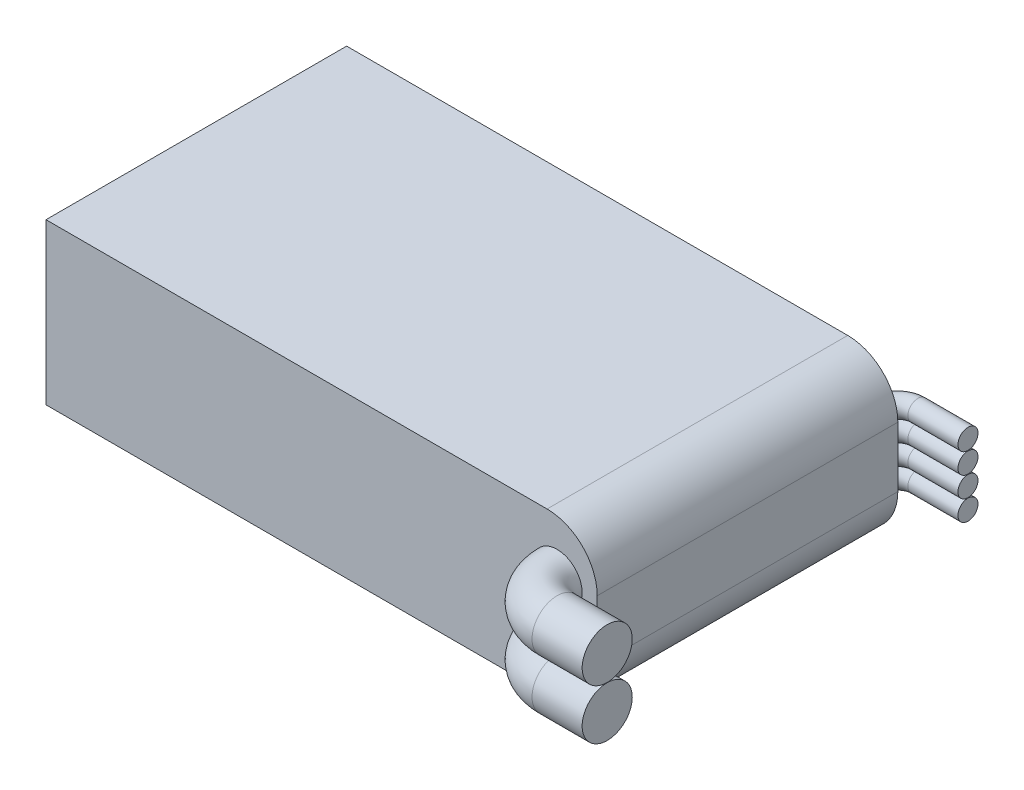
ISO-10303-21;
HEADER;
FILE_DESCRIPTION(('STEP AP214'),'2;1');
FILE_NAME('part.step','',(''),(''),'','','');
FILE_SCHEMA(('AUTOMOTIVE_DESIGN { 1 0 10303 214 1 1 1 1 }'));
ENDSEC;
DATA;
#1=APPLICATION_CONTEXT('core data for automotive mechanical design processes');
#2=APPLICATION_PROTOCOL_DEFINITION('international standard','automotive_design',2000,#1);
#3=PRODUCT_CONTEXT('',#1,'mechanical');
#4=PRODUCT('Part','Part','',(#3));
#5=PRODUCT_RELATED_PRODUCT_CATEGORY('part','',(#4));
#6=PRODUCT_DEFINITION_FORMATION('','',#4);
#7=PRODUCT_DEFINITION_CONTEXT('part definition',#1,'design');
#8=PRODUCT_DEFINITION('design','',#6,#7);
#9=PRODUCT_DEFINITION_SHAPE('','',#8);
#10=(LENGTH_UNIT() NAMED_UNIT(*) SI_UNIT(.MILLI.,.METRE.));
#11=(NAMED_UNIT(*) PLANE_ANGLE_UNIT() SI_UNIT($,.RADIAN.));
#12=(NAMED_UNIT(*) SI_UNIT($,.STERADIAN.) SOLID_ANGLE_UNIT());
#13=UNCERTAINTY_MEASURE_WITH_UNIT(LENGTH_MEASURE(1.E-05),#10,'distance_accuracy_value','');
#14=(GEOMETRIC_REPRESENTATION_CONTEXT(3) GLOBAL_UNCERTAINTY_ASSIGNED_CONTEXT((#13)) GLOBAL_UNIT_ASSIGNED_CONTEXT((#10,
#11,#12)) REPRESENTATION_CONTEXT('',''));
#15=CARTESIAN_POINT('',(0.,0.,0.));
#16=DIRECTION('',(0.,0.,1.));
#17=DIRECTION('',(1.,0.,0.));
#18=AXIS2_PLACEMENT_3D('',#15,#16,#17);
#19=CARTESIAN_POINT('',(27.5,16.,15.));
#20=DIRECTION('',(-1.,0.,0.));
#21=DIRECTION('',(0.,0.,1.));
#22=AXIS2_PLACEMENT_3D('',#19,#20,#21);
#23=PLANE('',#22);
#24=DIRECTION('',(0.,-1.,0.));
#25=VECTOR('',#24,1.);
#26=CARTESIAN_POINT('',(27.5,16.,15.));
#27=LINE('',#26,#25);
#28=CARTESIAN_POINT('',(27.5,11.,15.));
#29=VERTEX_POINT('',#28);
#30=CARTESIAN_POINT('',(27.5,5.,15.));
#31=VERTEX_POINT('',#30);
#32=EDGE_CURVE('E120',#29,#31,#27,.T.);
#33=ORIENTED_EDGE('',*,*,#32,.T.);
#34=DIRECTION('',(0.,0.,-1.));
#35=VECTOR('',#34,1.);
#36=CARTESIAN_POINT('',(27.5,5.,-15.));
#37=LINE('',#36,#35);
#38=CARTESIAN_POINT('',(27.5,5.,-15.));
#39=VERTEX_POINT('',#38);
#40=EDGE_CURVE('E135',#31,#39,#37,.T.);
#41=ORIENTED_EDGE('',*,*,#40,.T.);
#42=DIRECTION('',(0.,-1.,0.));
#43=VECTOR('',#42,1.);
#44=CARTESIAN_POINT('',(27.5,16.,-15.));
#45=LINE('',#44,#43);
#46=CARTESIAN_POINT('',(27.5,11.,-15.));
#47=VERTEX_POINT('',#46);
#48=EDGE_CURVE('E113',#47,#39,#45,.T.);
#49=ORIENTED_EDGE('',*,*,#48,.F.);
#50=DIRECTION('',(0.,0.,-1.));
#51=VECTOR('',#50,1.);
#52=CARTESIAN_POINT('',(27.5,11.,15.));
#53=LINE('',#52,#51);
#54=EDGE_CURVE('E133',#47,#29,#53,.F.);
#55=ORIENTED_EDGE('',*,*,#54,.T.);
#56=EDGE_LOOP('',(#33,#41,#49,#55));
#57=FACE_BOUND('',#56,.T.);
#58=ADVANCED_FACE('F37',(#57),#23,.F.);
#59=CARTESIAN_POINT('',(-27.5,16.,-15.));
#60=DIRECTION('',(0.,0.,1.));
#61=DIRECTION('',(1.,0.,0.));
#62=AXIS2_PLACEMENT_3D('',#59,#60,#61);
#63=PLANE('',#62);
#64=CARTESIAN_POINT('',(25.5,4.94,-15.));
#65=DIRECTION('',(0.,0.,-1.));
#66=DIRECTION('',(-1.,0.,0.));
#67=AXIS2_PLACEMENT_3D('',#64,#65,#66);
#68=CIRCLE('',#67,0.999999999999998);
#69=CARTESIAN_POINT('',(24.5,4.94,-15.));
#70=VERTEX_POINT('',#69);
#71=EDGE_CURVE('E246',#70,#70,#68,.T.);
#72=ORIENTED_EDGE('',*,*,#71,.F.);
#73=EDGE_LOOP('',(#72));
#74=FACE_BOUND('',#73,.T.);
#75=CARTESIAN_POINT('',(25.5,11.06,-15.));
#76=DIRECTION('',(0.,0.,-1.));
#77=DIRECTION('',(-1.,0.,0.));
#78=AXIS2_PLACEMENT_3D('',#75,#76,#77);
#79=CIRCLE('',#78,0.999999999999998);
#80=CARTESIAN_POINT('',(24.5,11.06,-15.));
#81=VERTEX_POINT('',#80);
#82=EDGE_CURVE('E237',#81,#81,#79,.T.);
#83=ORIENTED_EDGE('',*,*,#82,.F.);
#84=EDGE_LOOP('',(#83));
#85=FACE_BOUND('',#84,.T.);
#86=CARTESIAN_POINT('',(25.5,6.98,-15.));
#87=DIRECTION('',(0.,0.,-1.));
#88=DIRECTION('',(-1.,0.,0.));
#89=AXIS2_PLACEMENT_3D('',#86,#87,#88);
#90=CIRCLE('',#89,0.999999999999998);
#91=CARTESIAN_POINT('',(24.5,6.98,-15.));
#92=VERTEX_POINT('',#91);
#93=EDGE_CURVE('E228',#92,#92,#90,.T.);
#94=ORIENTED_EDGE('',*,*,#93,.F.);
#95=EDGE_LOOP('',(#94));
#96=FACE_BOUND('',#95,.T.);
#97=CARTESIAN_POINT('',(25.5,9.02,-15.));
#98=DIRECTION('',(0.,0.,-1.));
#99=DIRECTION('',(-1.,0.,0.));
#100=AXIS2_PLACEMENT_3D('',#97,#98,#99);
#101=CIRCLE('',#100,0.999999999999998);
#102=CARTESIAN_POINT('',(24.5,9.02,-15.));
#103=VERTEX_POINT('',#102);
#104=EDGE_CURVE('E11',#103,#103,#101,.T.);
#105=ORIENTED_EDGE('',*,*,#104,.F.);
#106=EDGE_LOOP('',(#105));
#107=FACE_BOUND('',#106,.T.);
#108=ORIENTED_EDGE('',*,*,#48,.T.);
#109=CARTESIAN_POINT('',(22.5,5.,-15.));
#110=DIRECTION('',(0.,0.,1.));
#111=DIRECTION('',(1.,0.,0.));
#112=AXIS2_PLACEMENT_3D('',#109,#110,#111);
#113=CIRCLE('',#112,5.);
#114=CARTESIAN_POINT('',(22.5,0.,-15.));
#115=VERTEX_POINT('',#114);
#116=EDGE_CURVE('E140',#39,#115,#113,.F.);
#117=ORIENTED_EDGE('',*,*,#116,.T.);
#118=DIRECTION('',(-1.,0.,0.));
#119=VECTOR('',#118,1.);
#120=CARTESIAN_POINT('',(-27.5,0.,-15.));
#121=LINE('',#120,#119);
#122=CARTESIAN_POINT('',(-27.5,0.,-15.));
#123=VERTEX_POINT('',#122);
#124=EDGE_CURVE('E110',#115,#123,#121,.T.);
#125=ORIENTED_EDGE('',*,*,#124,.T.);
#126=DIRECTION('',(0.,-1.,0.));
#127=VECTOR('',#126,1.);
#128=CARTESIAN_POINT('',(-27.5,16.,-15.));
#129=LINE('',#128,#127);
#130=CARTESIAN_POINT('',(-27.5,16.,-15.));
#131=VERTEX_POINT('',#130);
#132=EDGE_CURVE('E107',#131,#123,#129,.T.);
#133=ORIENTED_EDGE('',*,*,#132,.F.);
#134=DIRECTION('',(-1.,0.,0.));
#135=VECTOR('',#134,1.);
#136=CARTESIAN_POINT('',(-27.5,16.,-15.));
#137=LINE('',#136,#135);
#138=CARTESIAN_POINT('',(22.5,16.,-15.));
#139=VERTEX_POINT('',#138);
#140=EDGE_CURVE('E96',#139,#131,#137,.T.);
#141=ORIENTED_EDGE('',*,*,#140,.F.);
#142=CARTESIAN_POINT('',(22.5,11.,-15.));
#143=DIRECTION('',(0.,0.,1.));
#144=DIRECTION('',(1.,0.,0.));
#145=AXIS2_PLACEMENT_3D('',#142,#143,#144);
#146=CIRCLE('',#145,5.);
#147=EDGE_CURVE('E138',#139,#47,#146,.F.);
#148=ORIENTED_EDGE('',*,*,#147,.T.);
#149=EDGE_LOOP('',(#108,#117,#125,#133,#141,#148));
#150=FACE_BOUND('',#149,.T.);
#151=ADVANCED_FACE('F109',(#74,#85,#96,#107,#150),#63,.F.);
#152=CARTESIAN_POINT('',(-27.5,16.,15.));
#153=DIRECTION('',(1.,0.,0.));
#154=DIRECTION('',(0.,0.,-1.));
#155=AXIS2_PLACEMENT_3D('',#152,#153,#154);
#156=PLANE('',#155);
#157=DIRECTION('',(0.,0.,1.));
#158=VECTOR('',#157,1.);
#159=CARTESIAN_POINT('',(-27.5,0.,15.));
#160=LINE('',#159,#158);
#161=CARTESIAN_POINT('',(-27.5,0.,15.));
#162=VERTEX_POINT('',#161);
#163=EDGE_CURVE('E125',#123,#162,#160,.T.);
#164=ORIENTED_EDGE('',*,*,#163,.T.);
#165=DIRECTION('',(0.,-1.,0.));
#166=VECTOR('',#165,1.);
#167=CARTESIAN_POINT('',(-27.5,16.,15.));
#168=LINE('',#167,#166);
#169=CARTESIAN_POINT('',(-27.5,16.,15.));
#170=VERTEX_POINT('',#169);
#171=EDGE_CURVE('E114',#170,#162,#168,.T.);
#172=ORIENTED_EDGE('',*,*,#171,.F.);
#173=DIRECTION('',(0.,0.,1.));
#174=VECTOR('',#173,1.);
#175=CARTESIAN_POINT('',(-27.5,16.,15.));
#176=LINE('',#175,#174);
#177=EDGE_CURVE('E100',#131,#170,#176,.T.);
#178=ORIENTED_EDGE('',*,*,#177,.F.);
#179=ORIENTED_EDGE('',*,*,#132,.T.);
#180=EDGE_LOOP('',(#164,#172,#178,#179));
#181=FACE_BOUND('',#180,.T.);
#182=ADVANCED_FACE('F116',(#181),#156,.F.);
#183=CARTESIAN_POINT('',(-27.5,16.,15.));
#184=DIRECTION('',(0.,0.,-1.));
#185=DIRECTION('',(-1.,0.,0.));
#186=AXIS2_PLACEMENT_3D('',#183,#184,#185);
#187=PLANE('',#186);
#188=CARTESIAN_POINT('',(23.5,5.49,15.));
#189=DIRECTION('',(0.,0.,1.));
#190=DIRECTION('',(1.,0.,0.));
#191=AXIS2_PLACEMENT_3D('',#188,#189,#190);
#192=CIRCLE('',#191,2.5);
#193=CARTESIAN_POINT('',(21.,5.49,15.));
#194=VERTEX_POINT('',#193);
#195=EDGE_CURVE('E210',#194,#194,#192,.T.);
#196=ORIENTED_EDGE('',*,*,#195,.F.);
#197=EDGE_LOOP('',(#196));
#198=FACE_BOUND('',#197,.T.);
#199=CARTESIAN_POINT('',(23.5,10.51,15.));
#200=DIRECTION('',(0.,0.,1.));
#201=DIRECTION('',(1.,0.,0.));
#202=AXIS2_PLACEMENT_3D('',#199,#200,#201);
#203=CIRCLE('',#202,2.5);
#204=CARTESIAN_POINT('',(21.,10.51,15.));
#205=VERTEX_POINT('',#204);
#206=EDGE_CURVE('E46',#205,#205,#203,.T.);
#207=ORIENTED_EDGE('',*,*,#206,.F.);
#208=EDGE_LOOP('',(#207));
#209=FACE_BOUND('',#208,.T.);
#210=DIRECTION('',(1.,0.,0.));
#211=VECTOR('',#210,1.);
#212=CARTESIAN_POINT('',(-27.5,0.,15.));
#213=LINE('',#212,#211);
#214=CARTESIAN_POINT('',(22.5,0.,15.));
#215=VERTEX_POINT('',#214);
#216=EDGE_CURVE('E104',#162,#215,#213,.T.);
#217=ORIENTED_EDGE('',*,*,#216,.T.);
#218=CARTESIAN_POINT('',(22.5,5.,15.));
#219=DIRECTION('',(0.,0.,-1.));
#220=DIRECTION('',(-1.,0.,0.));
#221=AXIS2_PLACEMENT_3D('',#218,#219,#220);
#222=CIRCLE('',#221,5.);
#223=EDGE_CURVE('E143',#215,#31,#222,.F.);
#224=ORIENTED_EDGE('',*,*,#223,.T.);
#225=ORIENTED_EDGE('',*,*,#32,.F.);
#226=CARTESIAN_POINT('',(22.5,11.,15.));
#227=DIRECTION('',(0.,0.,-1.));
#228=DIRECTION('',(-1.,0.,0.));
#229=AXIS2_PLACEMENT_3D('',#226,#227,#228);
#230=CIRCLE('',#229,5.);
#231=CARTESIAN_POINT('',(22.5,16.,15.));
#232=VERTEX_POINT('',#231);
#233=EDGE_CURVE('E54',#29,#232,#230,.F.);
#234=ORIENTED_EDGE('',*,*,#233,.T.);
#235=DIRECTION('',(1.,0.,0.));
#236=VECTOR('',#235,1.);
#237=CARTESIAN_POINT('',(-27.5,16.,15.));
#238=LINE('',#237,#236);
#239=EDGE_CURVE('E118',#170,#232,#238,.T.);
#240=ORIENTED_EDGE('',*,*,#239,.F.);
#241=ORIENTED_EDGE('',*,*,#171,.T.);
#242=EDGE_LOOP('',(#217,#224,#225,#234,#240,#241));
#243=FACE_BOUND('',#242,.T.);
#244=ADVANCED_FACE('F198',(#198,#209,#243),#187,.F.);
#245=CARTESIAN_POINT('',(0.,16.,0.));
#246=DIRECTION('',(0.,-1.,0.));
#247=DIRECTION('',(0.,0.,-1.));
#248=AXIS2_PLACEMENT_3D('',#245,#246,#247);
#249=PLANE('',#248);
#250=ORIENTED_EDGE('',*,*,#239,.T.);
#251=DIRECTION('',(0.,0.,-1.));
#252=VECTOR('',#251,1.);
#253=CARTESIAN_POINT('',(22.5,16.,0.));
#254=LINE('',#253,#252);
#255=EDGE_CURVE('E41',#232,#139,#254,.T.);
#256=ORIENTED_EDGE('',*,*,#255,.T.);
#257=ORIENTED_EDGE('',*,*,#140,.T.);
#258=ORIENTED_EDGE('',*,*,#177,.T.);
#259=EDGE_LOOP('',(#250,#256,#257,#258));
#260=FACE_BOUND('',#259,.T.);
#261=ADVANCED_FACE('F98',(#260),#249,.F.);
#262=CARTESIAN_POINT('',(0.,0.,0.));
#263=DIRECTION('',(0.,-1.,0.));
#264=DIRECTION('',(0.,0.,-1.));
#265=AXIS2_PLACEMENT_3D('',#262,#263,#264);
#266=PLANE('',#265);
#267=ORIENTED_EDGE('',*,*,#124,.F.);
#268=DIRECTION('',(0.,0.,-1.));
#269=VECTOR('',#268,1.);
#270=CARTESIAN_POINT('',(22.5,0.,15.));
#271=LINE('',#270,#269);
#272=EDGE_CURVE('E62',#115,#215,#271,.F.);
#273=ORIENTED_EDGE('',*,*,#272,.T.);
#274=ORIENTED_EDGE('',*,*,#216,.F.);
#275=ORIENTED_EDGE('',*,*,#163,.F.);
#276=EDGE_LOOP('',(#267,#273,#274,#275));
#277=FACE_BOUND('',#276,.T.);
#278=ADVANCED_FACE('F187',(#277),#266,.T.);
#279=CARTESIAN_POINT('',(22.5,5.,15.));
#280=DIRECTION('',(0.,0.,1.));
#281=DIRECTION('',(1.,0.,0.));
#282=AXIS2_PLACEMENT_3D('',#279,#280,#281);
#283=CYLINDRICAL_SURFACE('',#282,5.);
#284=ORIENTED_EDGE('',*,*,#223,.F.);
#285=ORIENTED_EDGE('',*,*,#272,.F.);
#286=ORIENTED_EDGE('',*,*,#116,.F.);
#287=ORIENTED_EDGE('',*,*,#40,.F.);
#288=EDGE_LOOP('',(#284,#285,#286,#287));
#289=FACE_BOUND('',#288,.T.);
#290=ADVANCED_FACE('F185',(#289),#283,.T.);
#291=CARTESIAN_POINT('',(22.5,11.,0.));
#292=DIRECTION('',(0.,0.,-1.));
#293=DIRECTION('',(-1.,0.,0.));
#294=AXIS2_PLACEMENT_3D('',#291,#292,#293);
#295=CYLINDRICAL_SURFACE('',#294,5.);
#296=ORIENTED_EDGE('',*,*,#233,.F.);
#297=ORIENTED_EDGE('',*,*,#54,.F.);
#298=ORIENTED_EDGE('',*,*,#147,.F.);
#299=ORIENTED_EDGE('',*,*,#255,.F.);
#300=EDGE_LOOP('',(#296,#297,#298,#299));
#301=FACE_BOUND('',#300,.T.);
#302=ADVANCED_FACE('F39',(#301),#295,.T.);
#303=CARTESIAN_POINT('',(32.5,10.51,19.));
#304=DIRECTION('',(1.,0.,0.));
#305=DIRECTION('',(0.,0.,-1.));
#306=AXIS2_PLACEMENT_3D('',#303,#304,#305);
#307=PLANE('',#306);
#308=CARTESIAN_POINT('',(32.5,10.51,19.));
#309=DIRECTION('',(1.,0.,0.));
#310=DIRECTION('',(0.,0.,-1.));
#311=AXIS2_PLACEMENT_3D('',#308,#309,#310);
#312=CIRCLE('',#311,2.5);
#313=CARTESIAN_POINT('',(32.5,10.51,16.5));
#314=VERTEX_POINT('',#313);
#315=EDGE_CURVE('E126',#314,#314,#312,.T.);
#316=ORIENTED_EDGE('',*,*,#315,.T.);
#317=EDGE_LOOP('',(#316));
#318=FACE_BOUND('',#317,.T.);
#319=ADVANCED_FACE('F158',(#318),#307,.T.);
#320=CARTESIAN_POINT('',(27.5,10.51,15.));
#321=DIRECTION('',(0.,1.,0.));
#322=DIRECTION('',(0.,0.,1.));
#323=AXIS2_PLACEMENT_3D('',#320,#321,#322);
#324=TOROIDAL_SURFACE('',#323,3.99999999999999,2.5);
#325=CARTESIAN_POINT('',(27.5,10.51,19.));
#326=DIRECTION('',(1.,0.,0.));
#327=DIRECTION('',(0.,0.,-1.));
#328=AXIS2_PLACEMENT_3D('',#325,#326,#327);
#329=CIRCLE('',#328,2.5);
#330=CARTESIAN_POINT('',(27.5,10.51,21.5));
#331=VERTEX_POINT('',#330);
#332=EDGE_CURVE('E153',#331,#331,#329,.T.);
#333=CARTESIAN_POINT('',(27.5,10.51,15.));
#334=DIRECTION('',(0.,1.,0.));
#335=DIRECTION('',(0.,0.,1.));
#336=AXIS2_PLACEMENT_3D('',#333,#334,#335);
#337=CIRCLE('',#336,6.5);
#338=EDGE_CURVE('',#205,#331,#337,.T.);
#339=ORIENTED_EDGE('',*,*,#206,.T.);
#340=ORIENTED_EDGE('',*,*,#332,.F.);
#341=ORIENTED_EDGE('',*,*,#338,.T.);
#342=ORIENTED_EDGE('',*,*,#338,.F.);
#343=EDGE_LOOP('',(#339,#341,#340,#342));
#344=FACE_BOUND('',#343,.T.);
#345=ADVANCED_FACE('F164',(#344),#324,.T.);
#346=CARTESIAN_POINT('',(27.5,10.51,19.));
#347=DIRECTION('',(1.,0.,0.));
#348=DIRECTION('',(0.,0.,-1.));
#349=AXIS2_PLACEMENT_3D('',#346,#347,#348);
#350=CYLINDRICAL_SURFACE('',#349,2.5);
#351=ORIENTED_EDGE('',*,*,#315,.F.);
#352=EDGE_LOOP('',(#351));
#353=FACE_BOUND('',#352,.T.);
#354=ORIENTED_EDGE('',*,*,#332,.T.);
#355=EDGE_LOOP('',(#354));
#356=FACE_BOUND('',#355,.T.);
#357=ADVANCED_FACE('F160',(#353,#356),#350,.T.);
#358=CARTESIAN_POINT('',(32.5,5.49,19.));
#359=DIRECTION('',(1.,0.,0.));
#360=DIRECTION('',(0.,0.,-1.));
#361=AXIS2_PLACEMENT_3D('',#358,#359,#360);
#362=PLANE('',#361);
#363=CARTESIAN_POINT('',(32.5,5.49,19.));
#364=DIRECTION('',(1.,0.,0.));
#365=DIRECTION('',(0.,0.,-1.));
#366=AXIS2_PLACEMENT_3D('',#363,#364,#365);
#367=CIRCLE('',#366,2.5);
#368=CARTESIAN_POINT('',(32.5,5.49,16.5));
#369=VERTEX_POINT('',#368);
#370=EDGE_CURVE('E151',#369,#369,#367,.T.);
#371=ORIENTED_EDGE('',*,*,#370,.T.);
#372=EDGE_LOOP('',(#371));
#373=FACE_BOUND('',#372,.T.);
#374=ADVANCED_FACE('F163',(#373),#362,.T.);
#375=CARTESIAN_POINT('',(27.5,5.49,15.));
#376=DIRECTION('',(0.,1.,0.));
#377=DIRECTION('',(0.,0.,1.));
#378=AXIS2_PLACEMENT_3D('',#375,#376,#377);
#379=TOROIDAL_SURFACE('',#378,3.99999999999999,2.5);
#380=CARTESIAN_POINT('',(27.5,5.49,19.));
#381=DIRECTION('',(1.,0.,0.));
#382=DIRECTION('',(0.,0.,-1.));
#383=AXIS2_PLACEMENT_3D('',#380,#381,#382);
#384=CIRCLE('',#383,2.5);
#385=CARTESIAN_POINT('',(27.5,5.49,21.5));
#386=VERTEX_POINT('',#385);
#387=EDGE_CURVE('E212',#386,#386,#384,.T.);
#388=CARTESIAN_POINT('',(27.5,5.49,15.));
#389=DIRECTION('',(0.,1.,0.));
#390=DIRECTION('',(0.,0.,1.));
#391=AXIS2_PLACEMENT_3D('',#388,#389,#390);
#392=CIRCLE('',#391,6.5);
#393=EDGE_CURVE('',#194,#386,#392,.T.);
#394=ORIENTED_EDGE('',*,*,#195,.T.);
#395=ORIENTED_EDGE('',*,*,#387,.F.);
#396=ORIENTED_EDGE('',*,*,#393,.T.);
#397=ORIENTED_EDGE('',*,*,#393,.F.);
#398=EDGE_LOOP('',(#394,#396,#395,#397));
#399=FACE_BOUND('',#398,.T.);
#400=ADVANCED_FACE('F278',(#399),#379,.T.);
#401=CARTESIAN_POINT('',(27.5,5.49,19.));
#402=DIRECTION('',(1.,0.,0.));
#403=DIRECTION('',(0.,0.,-1.));
#404=AXIS2_PLACEMENT_3D('',#401,#402,#403);
#405=CYLINDRICAL_SURFACE('',#404,2.5);
#406=ORIENTED_EDGE('',*,*,#370,.F.);
#407=EDGE_LOOP('',(#406));
#408=FACE_BOUND('',#407,.T.);
#409=ORIENTED_EDGE('',*,*,#387,.T.);
#410=EDGE_LOOP('',(#409));
#411=FACE_BOUND('',#410,.T.);
#412=ADVANCED_FACE('F174',(#408,#411),#405,.T.);
#413=CARTESIAN_POINT('',(32.5,9.02,-17.));
#414=DIRECTION('',(1.,0.,0.));
#415=DIRECTION('',(0.,0.,-1.));
#416=AXIS2_PLACEMENT_3D('',#413,#414,#415);
#417=PLANE('',#416);
#418=CARTESIAN_POINT('',(32.5,9.02,-17.));
#419=DIRECTION('',(1.,0.,0.));
#420=DIRECTION('',(0.,0.,-1.));
#421=AXIS2_PLACEMENT_3D('',#418,#419,#420);
#422=CIRCLE('',#421,0.999999999999998);
#423=CARTESIAN_POINT('',(32.5,9.02,-18.));
#424=VERTEX_POINT('',#423);
#425=EDGE_CURVE('E213',#424,#424,#422,.T.);
#426=ORIENTED_EDGE('',*,*,#425,.T.);
#427=EDGE_LOOP('',(#426));
#428=FACE_BOUND('',#427,.T.);
#429=ADVANCED_FACE('F261',(#428),#417,.T.);
#430=CARTESIAN_POINT('',(27.5,9.02,-15.));
#431=DIRECTION('',(0.,-1.,0.));
#432=DIRECTION('',(0.,0.,-1.));
#433=AXIS2_PLACEMENT_3D('',#430,#431,#432);
#434=TOROIDAL_SURFACE('',#433,1.99999999999999,0.999999999999998);
#435=CARTESIAN_POINT('',(27.5,9.02,-17.));
#436=DIRECTION('',(1.,0.,0.));
#437=DIRECTION('',(0.,0.,-1.));
#438=AXIS2_PLACEMENT_3D('',#435,#436,#437);
#439=CIRCLE('',#438,0.999999999999998);
#440=CARTESIAN_POINT('',(27.5,9.02,-18.));
#441=VERTEX_POINT('',#440);
#442=EDGE_CURVE('E217',#441,#441,#439,.T.);
#443=CARTESIAN_POINT('',(27.5,9.02,-15.));
#444=DIRECTION('',(0.,-1.,0.));
#445=DIRECTION('',(0.,0.,-1.));
#446=AXIS2_PLACEMENT_3D('',#443,#444,#445);
#447=CIRCLE('',#446,2.99999999999999);
#448=EDGE_CURVE('',#103,#441,#447,.T.);
#449=ORIENTED_EDGE('',*,*,#104,.T.);
#450=ORIENTED_EDGE('',*,*,#442,.F.);
#451=ORIENTED_EDGE('',*,*,#448,.T.);
#452=ORIENTED_EDGE('',*,*,#448,.F.);
#453=EDGE_LOOP('',(#449,#451,#450,#452));
#454=FACE_BOUND('',#453,.T.);
#455=ADVANCED_FACE('F258',(#454),#434,.T.);
#456=CARTESIAN_POINT('',(27.5,9.02,-17.));
#457=DIRECTION('',(1.,0.,0.));
#458=DIRECTION('',(0.,0.,-1.));
#459=AXIS2_PLACEMENT_3D('',#456,#457,#458);
#460=CYLINDRICAL_SURFACE('',#459,0.999999999999998);
#461=ORIENTED_EDGE('',*,*,#425,.F.);
#462=EDGE_LOOP('',(#461));
#463=FACE_BOUND('',#462,.T.);
#464=ORIENTED_EDGE('',*,*,#442,.T.);
#465=EDGE_LOOP('',(#464));
#466=FACE_BOUND('',#465,.T.);
#467=ADVANCED_FACE('F260',(#463,#466),#460,.T.);
#468=CARTESIAN_POINT('',(32.5,6.98,-17.));
#469=DIRECTION('',(1.,0.,0.));
#470=DIRECTION('',(0.,0.,-1.));
#471=AXIS2_PLACEMENT_3D('',#468,#469,#470);
#472=PLANE('',#471);
#473=CARTESIAN_POINT('',(32.5,6.98,-17.));
#474=DIRECTION('',(1.,0.,0.));
#475=DIRECTION('',(0.,0.,-1.));
#476=AXIS2_PLACEMENT_3D('',#473,#474,#475);
#477=CIRCLE('',#476,0.999999999999998);
#478=CARTESIAN_POINT('',(32.5,6.98,-18.));
#479=VERTEX_POINT('',#478);
#480=EDGE_CURVE('E221',#479,#479,#477,.T.);
#481=ORIENTED_EDGE('',*,*,#480,.T.);
#482=EDGE_LOOP('',(#481));
#483=FACE_BOUND('',#482,.T.);
#484=ADVANCED_FACE('F268',(#483),#472,.T.);
#485=CARTESIAN_POINT('',(27.5,6.98,-15.));
#486=DIRECTION('',(0.,-1.,0.));
#487=DIRECTION('',(0.,0.,-1.));
#488=AXIS2_PLACEMENT_3D('',#485,#486,#487);
#489=TOROIDAL_SURFACE('',#488,1.99999999999999,0.999999999999998);
#490=CARTESIAN_POINT('',(27.5,6.98,-17.));
#491=DIRECTION('',(1.,0.,0.));
#492=DIRECTION('',(0.,0.,-1.));
#493=AXIS2_PLACEMENT_3D('',#490,#491,#492);
#494=CIRCLE('',#493,0.999999999999998);
#495=CARTESIAN_POINT('',(27.5,6.98,-18.));
#496=VERTEX_POINT('',#495);
#497=EDGE_CURVE('E225',#496,#496,#494,.T.);
#498=CARTESIAN_POINT('',(27.5,6.98,-15.));
#499=DIRECTION('',(0.,-1.,0.));
#500=DIRECTION('',(0.,0.,-1.));
#501=AXIS2_PLACEMENT_3D('',#498,#499,#500);
#502=CIRCLE('',#501,2.99999999999999);
#503=EDGE_CURVE('',#92,#496,#502,.T.);
#504=ORIENTED_EDGE('',*,*,#93,.T.);
#505=ORIENTED_EDGE('',*,*,#497,.F.);
#506=ORIENTED_EDGE('',*,*,#503,.T.);
#507=ORIENTED_EDGE('',*,*,#503,.F.);
#508=EDGE_LOOP('',(#504,#506,#505,#507));
#509=FACE_BOUND('',#508,.T.);
#510=ADVANCED_FACE('F330',(#509),#489,.T.);
#511=CARTESIAN_POINT('',(27.5,6.98,-17.));
#512=DIRECTION('',(1.,0.,0.));
#513=DIRECTION('',(0.,0.,-1.));
#514=AXIS2_PLACEMENT_3D('',#511,#512,#513);
#515=CYLINDRICAL_SURFACE('',#514,0.999999999999998);
#516=ORIENTED_EDGE('',*,*,#480,.F.);
#517=EDGE_LOOP('',(#516));
#518=FACE_BOUND('',#517,.T.);
#519=ORIENTED_EDGE('',*,*,#497,.T.);
#520=EDGE_LOOP('',(#519));
#521=FACE_BOUND('',#520,.T.);
#522=ADVANCED_FACE('F273',(#518,#521),#515,.T.);
#523=CARTESIAN_POINT('',(32.5,11.06,-17.));
#524=DIRECTION('',(1.,0.,0.));
#525=DIRECTION('',(0.,0.,-1.));
#526=AXIS2_PLACEMENT_3D('',#523,#524,#525);
#527=PLANE('',#526);
#528=CARTESIAN_POINT('',(32.5,11.06,-17.));
#529=DIRECTION('',(1.,0.,0.));
#530=DIRECTION('',(0.,0.,-1.));
#531=AXIS2_PLACEMENT_3D('',#528,#529,#530);
#532=CIRCLE('',#531,0.999999999999998);
#533=CARTESIAN_POINT('',(32.5,11.06,-18.));
#534=VERTEX_POINT('',#533);
#535=EDGE_CURVE('E231',#534,#534,#532,.T.);
#536=ORIENTED_EDGE('',*,*,#535,.T.);
#537=EDGE_LOOP('',(#536));
#538=FACE_BOUND('',#537,.T.);
#539=ADVANCED_FACE('F314',(#538),#527,.T.);
#540=CARTESIAN_POINT('',(27.5,11.06,-15.));
#541=DIRECTION('',(0.,-1.,0.));
#542=DIRECTION('',(0.,0.,-1.));
#543=AXIS2_PLACEMENT_3D('',#540,#541,#542);
#544=TOROIDAL_SURFACE('',#543,1.99999999999999,0.999999999999998);
#545=CARTESIAN_POINT('',(27.5,11.06,-17.));
#546=DIRECTION('',(1.,0.,0.));
#547=DIRECTION('',(0.,0.,-1.));
#548=AXIS2_PLACEMENT_3D('',#545,#546,#547);
#549=CIRCLE('',#548,0.999999999999998);
#550=CARTESIAN_POINT('',(27.5,11.06,-18.));
#551=VERTEX_POINT('',#550);
#552=EDGE_CURVE('E234',#551,#551,#549,.T.);
#553=CARTESIAN_POINT('',(27.5,11.06,-15.));
#554=DIRECTION('',(0.,-1.,0.));
#555=DIRECTION('',(0.,0.,-1.));
#556=AXIS2_PLACEMENT_3D('',#553,#554,#555);
#557=CIRCLE('',#556,2.99999999999999);
#558=EDGE_CURVE('',#81,#551,#557,.T.);
#559=ORIENTED_EDGE('',*,*,#82,.T.);
#560=ORIENTED_EDGE('',*,*,#552,.F.);
#561=ORIENTED_EDGE('',*,*,#558,.T.);
#562=ORIENTED_EDGE('',*,*,#558,.F.);
#563=EDGE_LOOP('',(#559,#561,#560,#562));
#564=FACE_BOUND('',#563,.T.);
#565=ADVANCED_FACE('F359',(#564),#544,.T.);
#566=CARTESIAN_POINT('',(27.5,11.06,-17.));
#567=DIRECTION('',(1.,0.,0.));
#568=DIRECTION('',(0.,0.,-1.));
#569=AXIS2_PLACEMENT_3D('',#566,#567,#568);
#570=CYLINDRICAL_SURFACE('',#569,0.999999999999998);
#571=ORIENTED_EDGE('',*,*,#535,.F.);
#572=EDGE_LOOP('',(#571));
#573=FACE_BOUND('',#572,.T.);
#574=ORIENTED_EDGE('',*,*,#552,.T.);
#575=EDGE_LOOP('',(#574));
#576=FACE_BOUND('',#575,.T.);
#577=ADVANCED_FACE('F351',(#573,#576),#570,.T.);
#578=CARTESIAN_POINT('',(32.5,4.94,-17.));
#579=DIRECTION('',(1.,0.,0.));
#580=DIRECTION('',(0.,0.,-1.));
#581=AXIS2_PLACEMENT_3D('',#578,#579,#580);
#582=PLANE('',#581);
#583=CARTESIAN_POINT('',(32.5,4.94,-17.));
#584=DIRECTION('',(1.,0.,0.));
#585=DIRECTION('',(0.,0.,-1.));
#586=AXIS2_PLACEMENT_3D('',#583,#584,#585);
#587=CIRCLE('',#586,0.999999999999998);
#588=CARTESIAN_POINT('',(32.5,4.94,-18.));
#589=VERTEX_POINT('',#588);
#590=EDGE_CURVE('E240',#589,#589,#587,.T.);
#591=ORIENTED_EDGE('',*,*,#590,.T.);
#592=EDGE_LOOP('',(#591));
#593=FACE_BOUND('',#592,.T.);
#594=ADVANCED_FACE('F358',(#593),#582,.T.);
#595=CARTESIAN_POINT('',(27.5,4.94,-15.));
#596=DIRECTION('',(0.,-1.,0.));
#597=DIRECTION('',(0.,0.,-1.));
#598=AXIS2_PLACEMENT_3D('',#595,#596,#597);
#599=TOROIDAL_SURFACE('',#598,1.99999999999999,0.999999999999998);
#600=CARTESIAN_POINT('',(27.5,4.94,-17.));
#601=DIRECTION('',(1.,0.,0.));
#602=DIRECTION('',(0.,0.,-1.));
#603=AXIS2_PLACEMENT_3D('',#600,#601,#602);
#604=CIRCLE('',#603,0.999999999999998);
#605=CARTESIAN_POINT('',(27.5,4.94,-18.));
#606=VERTEX_POINT('',#605);
#607=EDGE_CURVE('E243',#606,#606,#604,.T.);
#608=CARTESIAN_POINT('',(27.5,4.94,-15.));
#609=DIRECTION('',(0.,-1.,0.));
#610=DIRECTION('',(0.,0.,-1.));
#611=AXIS2_PLACEMENT_3D('',#608,#609,#610);
#612=CIRCLE('',#611,2.99999999999999);
#613=EDGE_CURVE('',#70,#606,#612,.T.);
#614=ORIENTED_EDGE('',*,*,#71,.T.);
#615=ORIENTED_EDGE('',*,*,#607,.F.);
#616=ORIENTED_EDGE('',*,*,#613,.T.);
#617=ORIENTED_EDGE('',*,*,#613,.F.);
#618=EDGE_LOOP('',(#614,#616,#615,#617));
#619=FACE_BOUND('',#618,.T.);
#620=ADVANCED_FACE('F250',(#619),#599,.T.);
#621=CARTESIAN_POINT('',(27.5,4.94,-17.));
#622=DIRECTION('',(1.,0.,0.));
#623=DIRECTION('',(0.,0.,-1.));
#624=AXIS2_PLACEMENT_3D('',#621,#622,#623);
#625=CYLINDRICAL_SURFACE('',#624,0.999999999999998);
#626=ORIENTED_EDGE('',*,*,#590,.F.);
#627=EDGE_LOOP('',(#626));
#628=FACE_BOUND('',#627,.T.);
#629=ORIENTED_EDGE('',*,*,#607,.T.);
#630=EDGE_LOOP('',(#629));
#631=FACE_BOUND('',#630,.T.);
#632=ADVANCED_FACE('F380',(#628,#631),#625,.T.);
#633=CLOSED_SHELL('',(#58,#151,#182,#244,#261,#278,#290,#302,#319,#345,#357,#374,#400,#412,#429,
#455,#467,#484,#510,#522,#539,#565,#577,#594,#620,#632));
#634=MANIFOLD_SOLID_BREP('B2',#633);
#635=ADVANCED_BREP_SHAPE_REPRESENTATION('',(#18,#634),#14);
#636=SHAPE_DEFINITION_REPRESENTATION(#9,#635);
ENDSEC;
END-ISO-10303-21;
